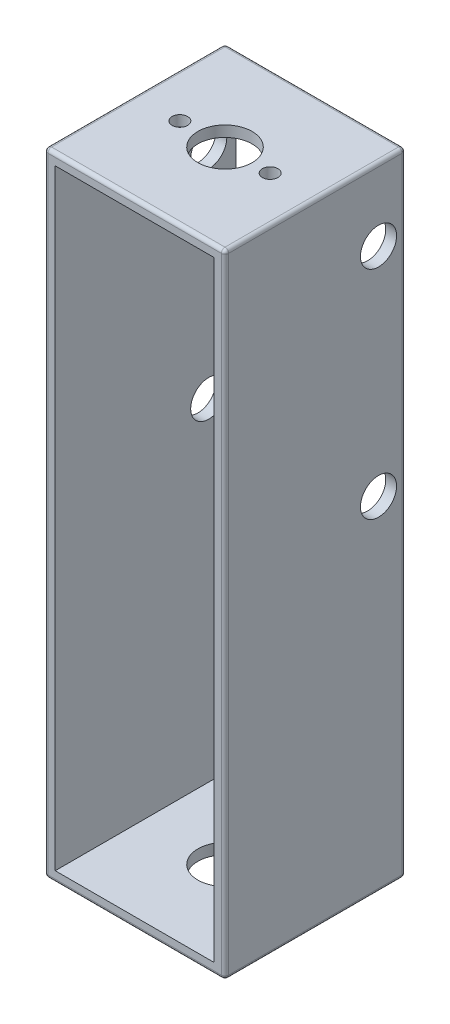
ISO-10303-21;
HEADER;
FILE_DESCRIPTION(('STEP AP214'),'2;1');
FILE_NAME('part.step','',(''),(''),'','','');
FILE_SCHEMA(('AUTOMOTIVE_DESIGN { 1 0 10303 214 1 1 1 1 }'));
ENDSEC;
DATA;
#1=APPLICATION_CONTEXT('core data for automotive mechanical design processes');
#2=APPLICATION_PROTOCOL_DEFINITION('international standard','automotive_design',2000,#1);
#3=PRODUCT_CONTEXT('',#1,'mechanical');
#4=PRODUCT('Part','Part','',(#3));
#5=PRODUCT_RELATED_PRODUCT_CATEGORY('part','',(#4));
#6=PRODUCT_DEFINITION_FORMATION('','',#4);
#7=PRODUCT_DEFINITION_CONTEXT('part definition',#1,'design');
#8=PRODUCT_DEFINITION('design','',#6,#7);
#9=PRODUCT_DEFINITION_SHAPE('','',#8);
#10=(LENGTH_UNIT() NAMED_UNIT(*) SI_UNIT(.MILLI.,.METRE.));
#11=(NAMED_UNIT(*) PLANE_ANGLE_UNIT() SI_UNIT($,.RADIAN.));
#12=(NAMED_UNIT(*) SI_UNIT($,.STERADIAN.) SOLID_ANGLE_UNIT());
#13=UNCERTAINTY_MEASURE_WITH_UNIT(LENGTH_MEASURE(1.E-05),#10,'distance_accuracy_value','');
#14=(GEOMETRIC_REPRESENTATION_CONTEXT(3) GLOBAL_UNCERTAINTY_ASSIGNED_CONTEXT((#13)) GLOBAL_UNIT_ASSIGNED_CONTEXT((#10,
#11,#12)) REPRESENTATION_CONTEXT('',''));
#15=CARTESIAN_POINT('',(0.,0.,0.));
#16=DIRECTION('',(0.,0.,1.));
#17=DIRECTION('',(1.,0.,0.));
#18=AXIS2_PLACEMENT_3D('',#15,#16,#17);
#19=CARTESIAN_POINT('',(25.,-175.,-25.));
#20=DIRECTION('',(0.,0.,-1.));
#21=DIRECTION('',(-1.,0.,0.));
#22=AXIS2_PLACEMENT_3D('',#19,#20,#21);
#23=PLANE('',#22);
#24=DIRECTION('',(0.,1.,0.));
#25=VECTOR('',#24,1.);
#26=CARTESIAN_POINT('',(24.,-175.,-25.));
#27=LINE('',#26,#25);
#28=CARTESIAN_POINT('',(24.,-1.,-25.));
#29=VERTEX_POINT('',#28);
#30=CARTESIAN_POINT('',(24.,-174.,-25.));
#31=VERTEX_POINT('',#30);
#32=EDGE_CURVE('E219',#29,#31,#27,.F.);
#33=ORIENTED_EDGE('',*,*,#32,.T.);
#34=DIRECTION('',(-1.,0.,0.));
#35=VECTOR('',#34,1.);
#36=CARTESIAN_POINT('',(-25.,-174.,-25.));
#37=LINE('',#36,#35);
#38=CARTESIAN_POINT('',(-24.,-174.,-25.));
#39=VERTEX_POINT('',#38);
#40=EDGE_CURVE('E221',#31,#39,#37,.T.);
#41=ORIENTED_EDGE('',*,*,#40,.T.);
#42=DIRECTION('',(0.,1.,0.));
#43=VECTOR('',#42,1.);
#44=CARTESIAN_POINT('',(-24.,-175.,-25.));
#45=LINE('',#44,#43);
#46=CARTESIAN_POINT('',(-24.,-1.,-25.));
#47=VERTEX_POINT('',#46);
#48=EDGE_CURVE('E215',#39,#47,#45,.T.);
#49=ORIENTED_EDGE('',*,*,#48,.T.);
#50=DIRECTION('',(-1.,0.,0.));
#51=VECTOR('',#50,1.);
#52=CARTESIAN_POINT('',(25.,-1.,-25.));
#53=LINE('',#52,#51);
#54=EDGE_CURVE('E217',#47,#29,#53,.F.);
#55=ORIENTED_EDGE('',*,*,#54,.T.);
#56=EDGE_LOOP('',(#33,#41,#49,#55));
#57=FACE_BOUND('',#56,.T.);
#58=DIRECTION('',(0.,1.,0.));
#59=VECTOR('',#58,1.);
#60=CARTESIAN_POINT('',(22.,-175.,-25.));
#61=LINE('',#60,#59);
#62=CARTESIAN_POINT('',(22.,-172.,-25.));
#63=VERTEX_POINT('',#62);
#64=CARTESIAN_POINT('',(22.,-3.,-25.));
#65=VERTEX_POINT('',#64);
#66=EDGE_CURVE('E161',#63,#65,#61,.T.);
#67=ORIENTED_EDGE('',*,*,#66,.T.);
#68=DIRECTION('',(-1.,0.,0.));
#69=VECTOR('',#68,1.);
#70=CARTESIAN_POINT('',(0.,-3.,-25.));
#71=LINE('',#70,#69);
#72=CARTESIAN_POINT('',(-22.,-3.,-25.));
#73=VERTEX_POINT('',#72);
#74=EDGE_CURVE('E167',#65,#73,#71,.T.);
#75=ORIENTED_EDGE('',*,*,#74,.T.);
#76=DIRECTION('',(0.,1.,0.));
#77=VECTOR('',#76,1.);
#78=CARTESIAN_POINT('',(-22.,-175.,-25.));
#79=LINE('',#78,#77);
#80=CARTESIAN_POINT('',(-22.,-172.,-25.));
#81=VERTEX_POINT('',#80);
#82=EDGE_CURVE('E150',#81,#73,#79,.T.);
#83=ORIENTED_EDGE('',*,*,#82,.F.);
#84=DIRECTION('',(-1.,0.,0.));
#85=VECTOR('',#84,1.);
#86=CARTESIAN_POINT('',(0.,-172.,-25.));
#87=LINE('',#86,#85);
#88=EDGE_CURVE('E181',#63,#81,#87,.T.);
#89=ORIENTED_EDGE('',*,*,#88,.F.);
#90=EDGE_LOOP('',(#67,#75,#83,#89));
#91=FACE_BOUND('',#90,.T.);
#92=ADVANCED_FACE('F33',(#57,#91),#23,.T.);
#93=CARTESIAN_POINT('',(25.,-175.,25.));
#94=DIRECTION('',(0.,0.,1.));
#95=DIRECTION('',(1.,0.,0.));
#96=AXIS2_PLACEMENT_3D('',#93,#94,#95);
#97=PLANE('',#96);
#98=DIRECTION('',(0.,1.,0.));
#99=VECTOR('',#98,1.);
#100=CARTESIAN_POINT('',(-24.,-175.,25.));
#101=LINE('',#100,#99);
#102=CARTESIAN_POINT('',(-24.,-1.,25.));
#103=VERTEX_POINT('',#102);
#104=CARTESIAN_POINT('',(-24.,-174.,25.));
#105=VERTEX_POINT('',#104);
#106=EDGE_CURVE('E237',#103,#105,#101,.F.);
#107=ORIENTED_EDGE('',*,*,#106,.T.);
#108=DIRECTION('',(1.,0.,0.));
#109=VECTOR('',#108,1.);
#110=CARTESIAN_POINT('',(25.,-174.,25.));
#111=LINE('',#110,#109);
#112=CARTESIAN_POINT('',(24.,-174.,25.));
#113=VERTEX_POINT('',#112);
#114=EDGE_CURVE('E239',#105,#113,#111,.T.);
#115=ORIENTED_EDGE('',*,*,#114,.T.);
#116=DIRECTION('',(0.,1.,0.));
#117=VECTOR('',#116,1.);
#118=CARTESIAN_POINT('',(24.,-175.,25.));
#119=LINE('',#118,#117);
#120=CARTESIAN_POINT('',(24.,-1.,25.));
#121=VERTEX_POINT('',#120);
#122=EDGE_CURVE('E235',#113,#121,#119,.T.);
#123=ORIENTED_EDGE('',*,*,#122,.T.);
#124=DIRECTION('',(1.,0.,0.));
#125=VECTOR('',#124,1.);
#126=CARTESIAN_POINT('',(25.,-1.,25.));
#127=LINE('',#126,#125);
#128=EDGE_CURVE('E233',#121,#103,#127,.F.);
#129=ORIENTED_EDGE('',*,*,#128,.T.);
#130=EDGE_LOOP('',(#107,#115,#123,#129));
#131=FACE_BOUND('',#130,.T.);
#132=DIRECTION('',(0.,1.,0.));
#133=VECTOR('',#132,1.);
#134=CARTESIAN_POINT('',(-22.,-175.,25.));
#135=LINE('',#134,#133);
#136=CARTESIAN_POINT('',(-22.,-172.,25.));
#137=VERTEX_POINT('',#136);
#138=CARTESIAN_POINT('',(-22.,-3.,25.));
#139=VERTEX_POINT('',#138);
#140=EDGE_CURVE('E183',#137,#139,#135,.T.);
#141=ORIENTED_EDGE('',*,*,#140,.T.);
#142=DIRECTION('',(1.,0.,0.));
#143=VECTOR('',#142,1.);
#144=CARTESIAN_POINT('',(0.,-3.,25.));
#145=LINE('',#144,#143);
#146=CARTESIAN_POINT('',(22.,-3.,25.));
#147=VERTEX_POINT('',#146);
#148=EDGE_CURVE('E170',#139,#147,#145,.T.);
#149=ORIENTED_EDGE('',*,*,#148,.T.);
#150=DIRECTION('',(0.,1.,0.));
#151=VECTOR('',#150,1.);
#152=CARTESIAN_POINT('',(22.,-175.,25.));
#153=LINE('',#152,#151);
#154=CARTESIAN_POINT('',(22.,-172.,25.));
#155=VERTEX_POINT('',#154);
#156=EDGE_CURVE('E180',#155,#147,#153,.T.);
#157=ORIENTED_EDGE('',*,*,#156,.F.);
#158=DIRECTION('',(1.,0.,0.));
#159=VECTOR('',#158,1.);
#160=CARTESIAN_POINT('',(0.,-172.,25.));
#161=LINE('',#160,#159);
#162=EDGE_CURVE('E175',#137,#155,#161,.T.);
#163=ORIENTED_EDGE('',*,*,#162,.F.);
#164=EDGE_LOOP('',(#141,#149,#157,#163));
#165=FACE_BOUND('',#164,.T.);
#166=ADVANCED_FACE('F362',(#131,#165),#97,.T.);
#167=CARTESIAN_POINT('',(-25.,-175.,25.));
#168=DIRECTION('',(-1.,0.,0.));
#169=DIRECTION('',(0.,0.,1.));
#170=AXIS2_PLACEMENT_3D('',#167,#168,#169);
#171=PLANE('',#170);
#172=DIRECTION('',(0.,1.,0.));
#173=VECTOR('',#172,1.);
#174=CARTESIAN_POINT('',(-25.,-175.,-24.));
#175=LINE('',#174,#173);
#176=CARTESIAN_POINT('',(-25.,-1.,-24.));
#177=VERTEX_POINT('',#176);
#178=CARTESIAN_POINT('',(-25.,-174.,-24.));
#179=VERTEX_POINT('',#178);
#180=EDGE_CURVE('E201',#177,#179,#175,.F.);
#181=ORIENTED_EDGE('',*,*,#180,.T.);
#182=DIRECTION('',(0.,0.,1.));
#183=VECTOR('',#182,1.);
#184=CARTESIAN_POINT('',(-25.,-174.,25.));
#185=LINE('',#184,#183);
#186=CARTESIAN_POINT('',(-25.,-174.,24.));
#187=VERTEX_POINT('',#186);
#188=EDGE_CURVE('E203',#179,#187,#185,.T.);
#189=ORIENTED_EDGE('',*,*,#188,.T.);
#190=DIRECTION('',(0.,1.,0.));
#191=VECTOR('',#190,1.);
#192=CARTESIAN_POINT('',(-25.,-175.,24.));
#193=LINE('',#192,#191);
#194=CARTESIAN_POINT('',(-25.,-1.,24.));
#195=VERTEX_POINT('',#194);
#196=EDGE_CURVE('E160',#187,#195,#193,.T.);
#197=ORIENTED_EDGE('',*,*,#196,.T.);
#198=DIRECTION('',(0.,0.,1.));
#199=VECTOR('',#198,1.);
#200=CARTESIAN_POINT('',(-25.,-1.,25.));
#201=LINE('',#200,#199);
#202=EDGE_CURVE('E199',#195,#177,#201,.F.);
#203=ORIENTED_EDGE('',*,*,#202,.T.);
#204=EDGE_LOOP('',(#181,#189,#197,#203));
#205=FACE_BOUND('',#204,.T.);
#206=CARTESIAN_POINT('',(-25.,-20.,-17.5));
#207=DIRECTION('',(1.,0.,0.));
#208=DIRECTION('',(0.,0.,-1.));
#209=AXIS2_PLACEMENT_3D('',#206,#207,#208);
#210=CIRCLE('',#209,5.);
#211=CARTESIAN_POINT('',(-25.,-20.,-22.5));
#212=VERTEX_POINT('',#211);
#213=EDGE_CURVE('E193',#212,#212,#210,.T.);
#214=ORIENTED_EDGE('',*,*,#213,.T.);
#215=EDGE_LOOP('',(#214));
#216=FACE_BOUND('',#215,.T.);
#217=CARTESIAN_POINT('',(-25.,-80.,-17.5));
#218=DIRECTION('',(1.,0.,0.));
#219=DIRECTION('',(0.,0.,-1.));
#220=AXIS2_PLACEMENT_3D('',#217,#218,#219);
#221=CIRCLE('',#220,5.);
#222=CARTESIAN_POINT('',(-25.,-80.,-22.5));
#223=VERTEX_POINT('',#222);
#224=EDGE_CURVE('E317',#223,#223,#221,.T.);
#225=ORIENTED_EDGE('',*,*,#224,.T.);
#226=EDGE_LOOP('',(#225));
#227=FACE_BOUND('',#226,.T.);
#228=ADVANCED_FACE('F364',(#205,#216,#227),#171,.T.);
#229=CARTESIAN_POINT('',(25.,-175.,25.));
#230=DIRECTION('',(1.,0.,0.));
#231=DIRECTION('',(0.,0.,-1.));
#232=AXIS2_PLACEMENT_3D('',#229,#230,#231);
#233=PLANE('',#232);
#234=DIRECTION('',(0.,1.,0.));
#235=VECTOR('',#234,1.);
#236=CARTESIAN_POINT('',(25.,-175.,24.));
#237=LINE('',#236,#235);
#238=CARTESIAN_POINT('',(25.,-1.,24.));
#239=VERTEX_POINT('',#238);
#240=CARTESIAN_POINT('',(25.,-174.,24.));
#241=VERTEX_POINT('',#240);
#242=EDGE_CURVE('E226',#239,#241,#237,.F.);
#243=ORIENTED_EDGE('',*,*,#242,.T.);
#244=DIRECTION('',(0.,0.,-1.));
#245=VECTOR('',#244,1.);
#246=CARTESIAN_POINT('',(25.,-174.,-25.));
#247=LINE('',#246,#245);
#248=CARTESIAN_POINT('',(25.,-174.,-24.));
#249=VERTEX_POINT('',#248);
#250=EDGE_CURVE('E230',#241,#249,#247,.T.);
#251=ORIENTED_EDGE('',*,*,#250,.T.);
#252=DIRECTION('',(0.,1.,0.));
#253=VECTOR('',#252,1.);
#254=CARTESIAN_POINT('',(25.,-175.,-24.));
#255=LINE('',#254,#253);
#256=CARTESIAN_POINT('',(25.,-1.,-24.));
#257=VERTEX_POINT('',#256);
#258=EDGE_CURVE('E228',#249,#257,#255,.T.);
#259=ORIENTED_EDGE('',*,*,#258,.T.);
#260=DIRECTION('',(0.,0.,-1.));
#261=VECTOR('',#260,1.);
#262=CARTESIAN_POINT('',(25.,-1.,25.));
#263=LINE('',#262,#261);
#264=EDGE_CURVE('E224',#257,#239,#263,.F.);
#265=ORIENTED_EDGE('',*,*,#264,.T.);
#266=EDGE_LOOP('',(#243,#251,#259,#265));
#267=FACE_BOUND('',#266,.T.);
#268=CARTESIAN_POINT('',(25.,-20.,-17.5));
#269=DIRECTION('',(1.,0.,0.));
#270=DIRECTION('',(0.,0.,-1.));
#271=AXIS2_PLACEMENT_3D('',#268,#269,#270);
#272=CIRCLE('',#271,5.);
#273=CARTESIAN_POINT('',(25.,-20.,-22.5));
#274=VERTEX_POINT('',#273);
#275=EDGE_CURVE('E322',#274,#274,#272,.T.);
#276=ORIENTED_EDGE('',*,*,#275,.F.);
#277=EDGE_LOOP('',(#276));
#278=FACE_BOUND('',#277,.T.);
#279=CARTESIAN_POINT('',(25.,-80.,-17.5));
#280=DIRECTION('',(1.,0.,0.));
#281=DIRECTION('',(0.,0.,-1.));
#282=AXIS2_PLACEMENT_3D('',#279,#280,#281);
#283=CIRCLE('',#282,5.);
#284=CARTESIAN_POINT('',(25.,-80.,-22.5));
#285=VERTEX_POINT('',#284);
#286=EDGE_CURVE('E311',#285,#285,#283,.T.);
#287=ORIENTED_EDGE('',*,*,#286,.F.);
#288=EDGE_LOOP('',(#287));
#289=FACE_BOUND('',#288,.T.);
#290=ADVANCED_FACE('F371',(#267,#278,#289),#233,.T.);
#291=CARTESIAN_POINT('',(0.,-175.,0.));
#292=DIRECTION('',(0.,1.,0.));
#293=DIRECTION('',(0.,0.,1.));
#294=AXIS2_PLACEMENT_3D('',#291,#292,#293);
#295=PLANE('',#294);
#296=DIRECTION('',(1.,0.,0.));
#297=VECTOR('',#296,1.);
#298=CARTESIAN_POINT('',(-25.,-175.,24.));
#299=LINE('',#298,#297);
#300=CARTESIAN_POINT('',(24.,-175.,24.));
#301=VERTEX_POINT('',#300);
#302=CARTESIAN_POINT('',(-24.,-175.,24.));
#303=VERTEX_POINT('',#302);
#304=EDGE_CURVE('E206',#301,#303,#299,.F.);
#305=ORIENTED_EDGE('',*,*,#304,.T.);
#306=DIRECTION('',(0.,0.,1.));
#307=VECTOR('',#306,1.);
#308=CARTESIAN_POINT('',(-24.,-175.,-25.));
#309=LINE('',#308,#307);
#310=CARTESIAN_POINT('',(-24.,-175.,-24.));
#311=VERTEX_POINT('',#310);
#312=EDGE_CURVE('E212',#303,#311,#309,.F.);
#313=ORIENTED_EDGE('',*,*,#312,.T.);
#314=DIRECTION('',(-1.,0.,0.));
#315=VECTOR('',#314,1.);
#316=CARTESIAN_POINT('',(25.,-175.,-24.));
#317=LINE('',#316,#315);
#318=CARTESIAN_POINT('',(24.,-175.,-24.));
#319=VERTEX_POINT('',#318);
#320=EDGE_CURVE('E210',#311,#319,#317,.F.);
#321=ORIENTED_EDGE('',*,*,#320,.T.);
#322=DIRECTION('',(0.,0.,-1.));
#323=VECTOR('',#322,1.);
#324=CARTESIAN_POINT('',(24.,-175.,25.));
#325=LINE('',#324,#323);
#326=EDGE_CURVE('E208',#319,#301,#325,.F.);
#327=ORIENTED_EDGE('',*,*,#326,.T.);
#328=EDGE_LOOP('',(#305,#313,#321,#327));
#329=FACE_BOUND('',#328,.T.);
#330=CARTESIAN_POINT('',(0.,-175.,0.));
#331=DIRECTION('',(0.,1.,0.));
#332=DIRECTION('',(0.,0.,1.));
#333=AXIS2_PLACEMENT_3D('',#330,#331,#332);
#334=CIRCLE('',#333,7.5);
#335=CARTESIAN_POINT('',(0.,-175.,7.5));
#336=VERTEX_POINT('',#335);
#337=EDGE_CURVE('E330',#336,#336,#334,.T.);
#338=ORIENTED_EDGE('',*,*,#337,.T.);
#339=EDGE_LOOP('',(#338));
#340=FACE_BOUND('',#339,.T.);
#341=ADVANCED_FACE('F497',(#329,#340),#295,.F.);
#342=CARTESIAN_POINT('',(0.,0.,0.));
#343=DIRECTION('',(0.,1.,0.));
#344=DIRECTION('',(0.,0.,1.));
#345=AXIS2_PLACEMENT_3D('',#342,#343,#344);
#346=PLANE('',#345);
#347=DIRECTION('',(0.,0.,-1.));
#348=VECTOR('',#347,1.);
#349=CARTESIAN_POINT('',(24.,0.,0.));
#350=LINE('',#349,#348);
#351=CARTESIAN_POINT('',(24.,0.,24.));
#352=VERTEX_POINT('',#351);
#353=CARTESIAN_POINT('',(24.,0.,-24.));
#354=VERTEX_POINT('',#353);
#355=EDGE_CURVE('E242',#352,#354,#350,.T.);
#356=ORIENTED_EDGE('',*,*,#355,.T.);
#357=DIRECTION('',(-1.,0.,0.));
#358=VECTOR('',#357,1.);
#359=CARTESIAN_POINT('',(0.,0.,-24.));
#360=LINE('',#359,#358);
#361=CARTESIAN_POINT('',(-24.,0.,-24.));
#362=VERTEX_POINT('',#361);
#363=EDGE_CURVE('E11',#354,#362,#360,.T.);
#364=ORIENTED_EDGE('',*,*,#363,.T.);
#365=DIRECTION('',(0.,0.,1.));
#366=VECTOR('',#365,1.);
#367=CARTESIAN_POINT('',(-24.,0.,0.));
#368=LINE('',#367,#366);
#369=CARTESIAN_POINT('',(-24.,0.,24.));
#370=VERTEX_POINT('',#369);
#371=EDGE_CURVE('E42',#362,#370,#368,.T.);
#372=ORIENTED_EDGE('',*,*,#371,.T.);
#373=DIRECTION('',(1.,0.,0.));
#374=VECTOR('',#373,1.);
#375=CARTESIAN_POINT('',(0.,0.,24.));
#376=LINE('',#375,#374);
#377=EDGE_CURVE('E244',#370,#352,#376,.T.);
#378=ORIENTED_EDGE('',*,*,#377,.T.);
#379=EDGE_LOOP('',(#356,#364,#372,#378));
#380=FACE_BOUND('',#379,.T.);
#381=CARTESIAN_POINT('',(12.5,0.,0.));
#382=DIRECTION('',(0.,1.,0.));
#383=DIRECTION('',(0.,0.,1.));
#384=AXIS2_PLACEMENT_3D('',#381,#382,#383);
#385=CIRCLE('',#384,2.15);
#386=CARTESIAN_POINT('',(12.5,0.,2.15));
#387=VERTEX_POINT('',#386);
#388=EDGE_CURVE('E336',#387,#387,#385,.T.);
#389=ORIENTED_EDGE('',*,*,#388,.F.);
#390=EDGE_LOOP('',(#389));
#391=FACE_BOUND('',#390,.T.);
#392=CARTESIAN_POINT('',(-12.5,0.,0.));
#393=DIRECTION('',(0.,1.,0.));
#394=DIRECTION('',(0.,0.,1.));
#395=AXIS2_PLACEMENT_3D('',#392,#393,#394);
#396=CIRCLE('',#395,2.15);
#397=CARTESIAN_POINT('',(-12.5,0.,2.15));
#398=VERTEX_POINT('',#397);
#399=EDGE_CURVE('E337',#398,#398,#396,.T.);
#400=ORIENTED_EDGE('',*,*,#399,.F.);
#401=EDGE_LOOP('',(#400));
#402=FACE_BOUND('',#401,.T.);
#403=CARTESIAN_POINT('',(0.,0.,0.));
#404=DIRECTION('',(0.,1.,0.));
#405=DIRECTION('',(0.,0.,1.));
#406=AXIS2_PLACEMENT_3D('',#403,#404,#405);
#407=CIRCLE('',#406,7.5);
#408=CARTESIAN_POINT('',(0.,0.,7.5));
#409=VERTEX_POINT('',#408);
#410=EDGE_CURVE('E344',#409,#409,#407,.T.);
#411=ORIENTED_EDGE('',*,*,#410,.F.);
#412=EDGE_LOOP('',(#411));
#413=FACE_BOUND('',#412,.T.);
#414=ADVANCED_FACE('F457',(#380,#391,#402,#413),#346,.T.);
#415=CARTESIAN_POINT('',(-22.,-175.,25.));
#416=DIRECTION('',(-1.,0.,0.));
#417=DIRECTION('',(0.,0.,1.));
#418=AXIS2_PLACEMENT_3D('',#415,#416,#417);
#419=PLANE('',#418);
#420=CARTESIAN_POINT('',(-22.,-20.,-17.5));
#421=DIRECTION('',(-1.,0.,0.));
#422=DIRECTION('',(0.,0.,1.));
#423=AXIS2_PLACEMENT_3D('',#420,#421,#422);
#424=CIRCLE('',#423,5.);
#425=CARTESIAN_POINT('',(-22.,-20.,-12.5));
#426=VERTEX_POINT('',#425);
#427=EDGE_CURVE('E197',#426,#426,#424,.T.);
#428=ORIENTED_EDGE('',*,*,#427,.T.);
#429=EDGE_LOOP('',(#428));
#430=FACE_BOUND('',#429,.T.);
#431=CARTESIAN_POINT('',(-22.,-80.,-17.5));
#432=DIRECTION('',(-1.,0.,0.));
#433=DIRECTION('',(0.,0.,1.));
#434=AXIS2_PLACEMENT_3D('',#431,#432,#433);
#435=CIRCLE('',#434,5.);
#436=CARTESIAN_POINT('',(-22.,-80.,-12.5));
#437=VERTEX_POINT('',#436);
#438=EDGE_CURVE('E192',#437,#437,#435,.T.);
#439=ORIENTED_EDGE('',*,*,#438,.T.);
#440=EDGE_LOOP('',(#439));
#441=FACE_BOUND('',#440,.T.);
#442=DIRECTION('',(0.,0.,1.));
#443=VECTOR('',#442,1.);
#444=CARTESIAN_POINT('',(-22.,-3.,0.));
#445=LINE('',#444,#443);
#446=EDGE_CURVE('E153',#73,#139,#445,.T.);
#447=ORIENTED_EDGE('',*,*,#446,.T.);
#448=ORIENTED_EDGE('',*,*,#140,.F.);
#449=DIRECTION('',(0.,0.,1.));
#450=VECTOR('',#449,1.);
#451=CARTESIAN_POINT('',(-22.,-172.,0.));
#452=LINE('',#451,#450);
#453=EDGE_CURVE('E156',#81,#137,#452,.T.);
#454=ORIENTED_EDGE('',*,*,#453,.F.);
#455=ORIENTED_EDGE('',*,*,#82,.T.);
#456=EDGE_LOOP('',(#447,#448,#454,#455));
#457=FACE_BOUND('',#456,.T.);
#458=ADVANCED_FACE('F152',(#430,#441,#457),#419,.F.);
#459=CARTESIAN_POINT('',(22.,-175.,25.));
#460=DIRECTION('',(1.,0.,0.));
#461=DIRECTION('',(0.,0.,-1.));
#462=AXIS2_PLACEMENT_3D('',#459,#460,#461);
#463=PLANE('',#462);
#464=CARTESIAN_POINT('',(22.,-20.,-17.5));
#465=DIRECTION('',(1.,0.,0.));
#466=DIRECTION('',(0.,0.,-1.));
#467=AXIS2_PLACEMENT_3D('',#464,#465,#466);
#468=CIRCLE('',#467,5.);
#469=CARTESIAN_POINT('',(22.,-20.,-22.5));
#470=VERTEX_POINT('',#469);
#471=EDGE_CURVE('E194',#470,#470,#468,.T.);
#472=ORIENTED_EDGE('',*,*,#471,.T.);
#473=EDGE_LOOP('',(#472));
#474=FACE_BOUND('',#473,.T.);
#475=CARTESIAN_POINT('',(22.,-80.,-17.5));
#476=DIRECTION('',(1.,0.,0.));
#477=DIRECTION('',(0.,0.,-1.));
#478=AXIS2_PLACEMENT_3D('',#475,#476,#477);
#479=CIRCLE('',#478,5.);
#480=CARTESIAN_POINT('',(22.,-80.,-22.5));
#481=VERTEX_POINT('',#480);
#482=EDGE_CURVE('E189',#481,#481,#479,.T.);
#483=ORIENTED_EDGE('',*,*,#482,.T.);
#484=EDGE_LOOP('',(#483));
#485=FACE_BOUND('',#484,.T.);
#486=DIRECTION('',(0.,0.,-1.));
#487=VECTOR('',#486,1.);
#488=CARTESIAN_POINT('',(22.,-3.,0.));
#489=LINE('',#488,#487);
#490=EDGE_CURVE('E173',#147,#65,#489,.T.);
#491=ORIENTED_EDGE('',*,*,#490,.T.);
#492=ORIENTED_EDGE('',*,*,#66,.F.);
#493=DIRECTION('',(0.,0.,-1.));
#494=VECTOR('',#493,1.);
#495=CARTESIAN_POINT('',(22.,-172.,0.));
#496=LINE('',#495,#494);
#497=EDGE_CURVE('E184',#155,#63,#496,.T.);
#498=ORIENTED_EDGE('',*,*,#497,.F.);
#499=ORIENTED_EDGE('',*,*,#156,.T.);
#500=EDGE_LOOP('',(#491,#492,#498,#499));
#501=FACE_BOUND('',#500,.T.);
#502=ADVANCED_FACE('F360',(#474,#485,#501),#463,.F.);
#503=CARTESIAN_POINT('',(0.,-172.,0.));
#504=DIRECTION('',(0.,1.,0.));
#505=DIRECTION('',(0.,0.,1.));
#506=AXIS2_PLACEMENT_3D('',#503,#504,#505);
#507=PLANE('',#506);
#508=CARTESIAN_POINT('',(0.,-172.,0.));
#509=DIRECTION('',(0.,1.,0.));
#510=DIRECTION('',(0.,0.,1.));
#511=AXIS2_PLACEMENT_3D('',#508,#509,#510);
#512=CIRCLE('',#511,7.5);
#513=CARTESIAN_POINT('',(0.,-172.,7.5));
#514=VERTEX_POINT('',#513);
#515=EDGE_CURVE('E333',#514,#514,#512,.T.);
#516=ORIENTED_EDGE('',*,*,#515,.F.);
#517=EDGE_LOOP('',(#516));
#518=FACE_BOUND('',#517,.T.);
#519=ORIENTED_EDGE('',*,*,#453,.T.);
#520=ORIENTED_EDGE('',*,*,#162,.T.);
#521=ORIENTED_EDGE('',*,*,#497,.T.);
#522=ORIENTED_EDGE('',*,*,#88,.T.);
#523=EDGE_LOOP('',(#519,#520,#521,#522));
#524=FACE_BOUND('',#523,.T.);
#525=ADVANCED_FACE('F356',(#518,#524),#507,.T.);
#526=CARTESIAN_POINT('',(0.,-3.,0.));
#527=DIRECTION('',(0.,1.,0.));
#528=DIRECTION('',(0.,0.,1.));
#529=AXIS2_PLACEMENT_3D('',#526,#527,#528);
#530=PLANE('',#529);
#531=CARTESIAN_POINT('',(12.5,-3.,0.));
#532=DIRECTION('',(0.,1.,0.));
#533=DIRECTION('',(0.,0.,1.));
#534=AXIS2_PLACEMENT_3D('',#531,#532,#533);
#535=CIRCLE('',#534,2.15);
#536=CARTESIAN_POINT('',(12.5,-3.,2.15));
#537=VERTEX_POINT('',#536);
#538=EDGE_CURVE('E341',#537,#537,#535,.F.);
#539=ORIENTED_EDGE('',*,*,#538,.F.);
#540=EDGE_LOOP('',(#539));
#541=FACE_BOUND('',#540,.T.);
#542=CARTESIAN_POINT('',(-12.5,-3.,0.));
#543=DIRECTION('',(0.,1.,0.));
#544=DIRECTION('',(0.,0.,1.));
#545=AXIS2_PLACEMENT_3D('',#542,#543,#544);
#546=CIRCLE('',#545,2.15);
#547=CARTESIAN_POINT('',(-12.5,-3.,2.15));
#548=VERTEX_POINT('',#547);
#549=EDGE_CURVE('E340',#548,#548,#546,.F.);
#550=ORIENTED_EDGE('',*,*,#549,.F.);
#551=EDGE_LOOP('',(#550));
#552=FACE_BOUND('',#551,.T.);
#553=CARTESIAN_POINT('',(0.,-3.,0.));
#554=DIRECTION('',(0.,1.,0.));
#555=DIRECTION('',(0.,0.,1.));
#556=AXIS2_PLACEMENT_3D('',#553,#554,#555);
#557=CIRCLE('',#556,7.5);
#558=CARTESIAN_POINT('',(0.,-3.,7.5));
#559=VERTEX_POINT('',#558);
#560=EDGE_CURVE('E171',#559,#559,#557,.F.);
#561=ORIENTED_EDGE('',*,*,#560,.F.);
#562=EDGE_LOOP('',(#561));
#563=FACE_BOUND('',#562,.T.);
#564=ORIENTED_EDGE('',*,*,#446,.F.);
#565=ORIENTED_EDGE('',*,*,#74,.F.);
#566=ORIENTED_EDGE('',*,*,#490,.F.);
#567=ORIENTED_EDGE('',*,*,#148,.F.);
#568=EDGE_LOOP('',(#564,#565,#566,#567));
#569=FACE_BOUND('',#568,.T.);
#570=ADVANCED_FACE('F165',(#541,#552,#563,#569),#530,.F.);
#571=CARTESIAN_POINT('',(0.,-175.001,0.));
#572=DIRECTION('',(0.,1.,0.));
#573=DIRECTION('',(0.,0.,1.));
#574=AXIS2_PLACEMENT_3D('',#571,#572,#573);
#575=CYLINDRICAL_SURFACE('',#574,7.5);
#576=ORIENTED_EDGE('',*,*,#410,.T.);
#577=EDGE_LOOP('',(#576));
#578=FACE_BOUND('',#577,.T.);
#579=ORIENTED_EDGE('',*,*,#560,.T.);
#580=EDGE_LOOP('',(#579));
#581=FACE_BOUND('',#580,.T.);
#582=ADVANCED_FACE('F522',(#578,#581),#575,.F.);
#583=CARTESIAN_POINT('',(-12.5,-175.001,0.));
#584=DIRECTION('',(0.,1.,0.));
#585=DIRECTION('',(0.,0.,1.));
#586=AXIS2_PLACEMENT_3D('',#583,#584,#585);
#587=CYLINDRICAL_SURFACE('',#586,2.15);
#588=ORIENTED_EDGE('',*,*,#399,.T.);
#589=EDGE_LOOP('',(#588));
#590=FACE_BOUND('',#589,.T.);
#591=ORIENTED_EDGE('',*,*,#549,.T.);
#592=EDGE_LOOP('',(#591));
#593=FACE_BOUND('',#592,.T.);
#594=ADVANCED_FACE('F516',(#590,#593),#587,.F.);
#595=CARTESIAN_POINT('',(12.5,-175.001,0.));
#596=DIRECTION('',(0.,1.,0.));
#597=DIRECTION('',(0.,0.,1.));
#598=AXIS2_PLACEMENT_3D('',#595,#596,#597);
#599=CYLINDRICAL_SURFACE('',#598,2.15);
#600=ORIENTED_EDGE('',*,*,#388,.T.);
#601=EDGE_LOOP('',(#600));
#602=FACE_BOUND('',#601,.T.);
#603=ORIENTED_EDGE('',*,*,#538,.T.);
#604=EDGE_LOOP('',(#603));
#605=FACE_BOUND('',#604,.T.);
#606=ADVANCED_FACE('F506',(#602,#605),#599,.F.);
#607=CARTESIAN_POINT('',(0.,-175.,0.));
#608=DIRECTION('',(0.,1.,0.));
#609=DIRECTION('',(0.,0.,1.));
#610=AXIS2_PLACEMENT_3D('',#607,#608,#609);
#611=CYLINDRICAL_SURFACE('',#610,7.5);
#612=ORIENTED_EDGE('',*,*,#515,.T.);
#613=EDGE_LOOP('',(#612));
#614=FACE_BOUND('',#613,.T.);
#615=ORIENTED_EDGE('',*,*,#337,.F.);
#616=EDGE_LOOP('',(#615));
#617=FACE_BOUND('',#616,.T.);
#618=ADVANCED_FACE('F503',(#614,#617),#611,.F.);
#619=CARTESIAN_POINT('',(-25.,-80.,-17.5));
#620=DIRECTION('',(1.,0.,0.));
#621=DIRECTION('',(0.,0.,-1.));
#622=AXIS2_PLACEMENT_3D('',#619,#620,#621);
#623=CYLINDRICAL_SURFACE('',#622,5.);
#624=ORIENTED_EDGE('',*,*,#286,.T.);
#625=EDGE_LOOP('',(#624));
#626=FACE_BOUND('',#625,.T.);
#627=ORIENTED_EDGE('',*,*,#482,.F.);
#628=EDGE_LOOP('',(#627));
#629=FACE_BOUND('',#628,.T.);
#630=ADVANCED_FACE('F505',(#626,#629),#623,.F.);
#631=CARTESIAN_POINT('',(-25.,-20.,-17.5));
#632=DIRECTION('',(1.,0.,0.));
#633=DIRECTION('',(0.,0.,-1.));
#634=AXIS2_PLACEMENT_3D('',#631,#632,#633);
#635=CYLINDRICAL_SURFACE('',#634,5.);
#636=ORIENTED_EDGE('',*,*,#275,.T.);
#637=EDGE_LOOP('',(#636));
#638=FACE_BOUND('',#637,.T.);
#639=ORIENTED_EDGE('',*,*,#471,.F.);
#640=EDGE_LOOP('',(#639));
#641=FACE_BOUND('',#640,.T.);
#642=ADVANCED_FACE('F513',(#638,#641),#635,.F.);
#643=ORIENTED_EDGE('',*,*,#224,.F.);
#644=EDGE_LOOP('',(#643));
#645=FACE_BOUND('',#644,.T.);
#646=ORIENTED_EDGE('',*,*,#438,.F.);
#647=EDGE_LOOP('',(#646));
#648=FACE_BOUND('',#647,.T.);
#649=ADVANCED_FACE('F515',(#645,#648),#623,.F.);
#650=ORIENTED_EDGE('',*,*,#213,.F.);
#651=EDGE_LOOP('',(#650));
#652=FACE_BOUND('',#651,.T.);
#653=ORIENTED_EDGE('',*,*,#427,.F.);
#654=EDGE_LOOP('',(#653));
#655=FACE_BOUND('',#654,.T.);
#656=ADVANCED_FACE('F452',(#652,#655),#635,.F.);
#657=CARTESIAN_POINT('',(24.,-1.,0.));
#658=DIRECTION('',(0.,0.,-1.));
#659=DIRECTION('',(-1.,0.,0.));
#660=AXIS2_PLACEMENT_3D('',#657,#658,#659);
#661=CYLINDRICAL_SURFACE('',#660,1.);
#662=CARTESIAN_POINT('',(24.,-1.,-24.));
#663=DIRECTION('',(0.,0.,-1.));
#664=DIRECTION('',(-1.,0.,0.));
#665=AXIS2_PLACEMENT_3D('',#662,#663,#664);
#666=CIRCLE('',#665,1.);
#667=EDGE_CURVE('E37',#354,#257,#666,.T.);
#668=ORIENTED_EDGE('',*,*,#667,.F.);
#669=ORIENTED_EDGE('',*,*,#355,.F.);
#670=CARTESIAN_POINT('',(24.,-1.,24.));
#671=DIRECTION('',(0.,0.,1.));
#672=DIRECTION('',(1.,0.,0.));
#673=AXIS2_PLACEMENT_3D('',#670,#671,#672);
#674=CIRCLE('',#673,1.);
#675=EDGE_CURVE('E304',#239,#352,#674,.T.);
#676=ORIENTED_EDGE('',*,*,#675,.F.);
#677=ORIENTED_EDGE('',*,*,#264,.F.);
#678=EDGE_LOOP('',(#668,#669,#676,#677));
#679=FACE_BOUND('',#678,.T.);
#680=ADVANCED_FACE('F35',(#679),#661,.T.);
#681=CARTESIAN_POINT('',(24.,-1.,-24.));
#682=DIRECTION('',(1.,0.,0.));
#683=DIRECTION('',(0.,0.,-1.));
#684=AXIS2_PLACEMENT_3D('',#681,#682,#683);
#685=SPHERICAL_SURFACE('',#684,1.);
#686=CARTESIAN_POINT('',(24.,-1.,-24.));
#687=DIRECTION('',(1.,0.,0.));
#688=DIRECTION('',(0.,0.,-1.));
#689=AXIS2_PLACEMENT_3D('',#686,#687,#688);
#690=CIRCLE('',#689,1.);
#691=EDGE_CURVE('E299',#354,#29,#690,.F.);
#692=ORIENTED_EDGE('',*,*,#691,.F.);
#693=ORIENTED_EDGE('',*,*,#667,.T.);
#694=CARTESIAN_POINT('',(24.,-1.,-24.));
#695=DIRECTION('',(0.,1.,0.));
#696=DIRECTION('',(0.,0.,1.));
#697=AXIS2_PLACEMENT_3D('',#694,#695,#696);
#698=CIRCLE('',#697,1.);
#699=EDGE_CURVE('E302',#29,#257,#698,.F.);
#700=ORIENTED_EDGE('',*,*,#699,.F.);
#701=EDGE_LOOP('',(#692,#693,#700));
#702=FACE_BOUND('',#701,.T.);
#703=ADVANCED_FACE('F447',(#702),#685,.T.);
#704=CARTESIAN_POINT('',(24.,-1.,24.));
#705=DIRECTION('',(0.,1.,0.));
#706=DIRECTION('',(0.,0.,1.));
#707=AXIS2_PLACEMENT_3D('',#704,#705,#706);
#708=SPHERICAL_SURFACE('',#707,1.);
#709=CARTESIAN_POINT('',(24.,-1.,24.));
#710=DIRECTION('',(0.,1.,0.));
#711=DIRECTION('',(0.,0.,1.));
#712=AXIS2_PLACEMENT_3D('',#709,#710,#711);
#713=CIRCLE('',#712,1.);
#714=EDGE_CURVE('E293',#239,#121,#713,.F.);
#715=ORIENTED_EDGE('',*,*,#714,.F.);
#716=ORIENTED_EDGE('',*,*,#675,.T.);
#717=CARTESIAN_POINT('',(24.,-1.,24.));
#718=DIRECTION('',(1.,0.,0.));
#719=DIRECTION('',(0.,0.,-1.));
#720=AXIS2_PLACEMENT_3D('',#717,#718,#719);
#721=CIRCLE('',#720,1.);
#722=EDGE_CURVE('E296',#121,#352,#721,.F.);
#723=ORIENTED_EDGE('',*,*,#722,.F.);
#724=EDGE_LOOP('',(#715,#716,#723));
#725=FACE_BOUND('',#724,.T.);
#726=ADVANCED_FACE('F444',(#725),#708,.T.);
#727=CARTESIAN_POINT('',(24.,-175.,-24.));
#728=DIRECTION('',(0.,1.,0.));
#729=DIRECTION('',(0.,0.,1.));
#730=AXIS2_PLACEMENT_3D('',#727,#728,#729);
#731=CYLINDRICAL_SURFACE('',#730,1.);
#732=ORIENTED_EDGE('',*,*,#699,.T.);
#733=ORIENTED_EDGE('',*,*,#258,.F.);
#734=CARTESIAN_POINT('',(24.,-174.,-24.));
#735=DIRECTION('',(0.,-1.,0.));
#736=DIRECTION('',(0.,0.,-1.));
#737=AXIS2_PLACEMENT_3D('',#734,#735,#736);
#738=CIRCLE('',#737,1.);
#739=EDGE_CURVE('E288',#31,#249,#738,.T.);
#740=ORIENTED_EDGE('',*,*,#739,.F.);
#741=ORIENTED_EDGE('',*,*,#32,.F.);
#742=EDGE_LOOP('',(#732,#733,#740,#741));
#743=FACE_BOUND('',#742,.T.);
#744=ADVANCED_FACE('F440',(#743),#731,.T.);
#745=CARTESIAN_POINT('',(0.,-1.,-24.));
#746=DIRECTION('',(-1.,0.,0.));
#747=DIRECTION('',(0.,0.,1.));
#748=AXIS2_PLACEMENT_3D('',#745,#746,#747);
#749=CYLINDRICAL_SURFACE('',#748,1.);
#750=ORIENTED_EDGE('',*,*,#691,.T.);
#751=ORIENTED_EDGE('',*,*,#54,.F.);
#752=CARTESIAN_POINT('',(-24.,-1.,-24.));
#753=DIRECTION('',(-1.,0.,0.));
#754=DIRECTION('',(0.,0.,1.));
#755=AXIS2_PLACEMENT_3D('',#752,#753,#754);
#756=CIRCLE('',#755,1.);
#757=EDGE_CURVE('E286',#362,#47,#756,.T.);
#758=ORIENTED_EDGE('',*,*,#757,.F.);
#759=ORIENTED_EDGE('',*,*,#363,.F.);
#760=EDGE_LOOP('',(#750,#751,#758,#759));
#761=FACE_BOUND('',#760,.T.);
#762=ADVANCED_FACE('F436',(#761),#749,.T.);
#763=CARTESIAN_POINT('',(-24.,-1.,0.));
#764=DIRECTION('',(0.,0.,1.));
#765=DIRECTION('',(1.,0.,0.));
#766=AXIS2_PLACEMENT_3D('',#763,#764,#765);
#767=CYLINDRICAL_SURFACE('',#766,1.);
#768=CARTESIAN_POINT('',(-24.,-1.,24.));
#769=DIRECTION('',(0.,0.,1.));
#770=DIRECTION('',(1.,0.,0.));
#771=AXIS2_PLACEMENT_3D('',#768,#769,#770);
#772=CIRCLE('',#771,1.);
#773=EDGE_CURVE('E282',#370,#195,#772,.T.);
#774=ORIENTED_EDGE('',*,*,#773,.F.);
#775=ORIENTED_EDGE('',*,*,#371,.F.);
#776=CARTESIAN_POINT('',(-24.,-1.,-24.));
#777=DIRECTION('',(0.,0.,-1.));
#778=DIRECTION('',(-1.,0.,0.));
#779=AXIS2_PLACEMENT_3D('',#776,#777,#778);
#780=CIRCLE('',#779,1.);
#781=EDGE_CURVE('E50',#177,#362,#780,.T.);
#782=ORIENTED_EDGE('',*,*,#781,.F.);
#783=ORIENTED_EDGE('',*,*,#202,.F.);
#784=EDGE_LOOP('',(#774,#775,#782,#783));
#785=FACE_BOUND('',#784,.T.);
#786=ADVANCED_FACE('F432',(#785),#767,.T.);
#787=CARTESIAN_POINT('',(0.,-1.,24.));
#788=DIRECTION('',(1.,0.,0.));
#789=DIRECTION('',(0.,0.,-1.));
#790=AXIS2_PLACEMENT_3D('',#787,#788,#789);
#791=CYLINDRICAL_SURFACE('',#790,1.);
#792=ORIENTED_EDGE('',*,*,#722,.T.);
#793=ORIENTED_EDGE('',*,*,#377,.F.);
#794=CARTESIAN_POINT('',(-24.,-1.,24.));
#795=DIRECTION('',(-1.,0.,0.));
#796=DIRECTION('',(0.,0.,1.));
#797=AXIS2_PLACEMENT_3D('',#794,#795,#796);
#798=CIRCLE('',#797,1.);
#799=EDGE_CURVE('E279',#103,#370,#798,.T.);
#800=ORIENTED_EDGE('',*,*,#799,.F.);
#801=ORIENTED_EDGE('',*,*,#128,.F.);
#802=EDGE_LOOP('',(#792,#793,#800,#801));
#803=FACE_BOUND('',#802,.T.);
#804=ADVANCED_FACE('F428',(#803),#791,.T.);
#805=CARTESIAN_POINT('',(24.,-175.,24.));
#806=DIRECTION('',(0.,1.,0.));
#807=DIRECTION('',(0.,0.,1.));
#808=AXIS2_PLACEMENT_3D('',#805,#806,#807);
#809=CYLINDRICAL_SURFACE('',#808,1.);
#810=ORIENTED_EDGE('',*,*,#714,.T.);
#811=ORIENTED_EDGE('',*,*,#122,.F.);
#812=CARTESIAN_POINT('',(24.,-174.,24.));
#813=DIRECTION('',(0.,-1.,0.));
#814=DIRECTION('',(0.,0.,-1.));
#815=AXIS2_PLACEMENT_3D('',#812,#813,#814);
#816=CIRCLE('',#815,1.);
#817=EDGE_CURVE('E276',#241,#113,#816,.T.);
#818=ORIENTED_EDGE('',*,*,#817,.F.);
#819=ORIENTED_EDGE('',*,*,#242,.F.);
#820=EDGE_LOOP('',(#810,#811,#818,#819));
#821=FACE_BOUND('',#820,.T.);
#822=ADVANCED_FACE('F424',(#821),#809,.T.);
#823=CARTESIAN_POINT('',(24.,-174.,25.));
#824=DIRECTION('',(0.,0.,1.));
#825=DIRECTION('',(1.,0.,0.));
#826=AXIS2_PLACEMENT_3D('',#823,#824,#825);
#827=CYLINDRICAL_SURFACE('',#826,1.);
#828=CARTESIAN_POINT('',(24.,-174.,-24.));
#829=DIRECTION('',(0.,0.,-1.));
#830=DIRECTION('',(-1.,0.,0.));
#831=AXIS2_PLACEMENT_3D('',#828,#829,#830);
#832=CIRCLE('',#831,1.);
#833=EDGE_CURVE('E290',#249,#319,#832,.T.);
#834=ORIENTED_EDGE('',*,*,#833,.F.);
#835=ORIENTED_EDGE('',*,*,#250,.F.);
#836=CARTESIAN_POINT('',(24.,-174.,24.));
#837=DIRECTION('',(0.,0.,1.));
#838=DIRECTION('',(1.,0.,0.));
#839=AXIS2_PLACEMENT_3D('',#836,#837,#838);
#840=CIRCLE('',#839,1.);
#841=EDGE_CURVE('E273',#301,#241,#840,.T.);
#842=ORIENTED_EDGE('',*,*,#841,.F.);
#843=ORIENTED_EDGE('',*,*,#326,.F.);
#844=EDGE_LOOP('',(#834,#835,#842,#843));
#845=FACE_BOUND('',#844,.T.);
#846=ADVANCED_FACE('F420',(#845),#827,.T.);
#847=CARTESIAN_POINT('',(24.,-174.,-24.));
#848=DIRECTION('',(1.,0.,0.));
#849=DIRECTION('',(0.,0.,-1.));
#850=AXIS2_PLACEMENT_3D('',#847,#848,#849);
#851=SPHERICAL_SURFACE('',#850,1.);
#852=ORIENTED_EDGE('',*,*,#739,.T.);
#853=ORIENTED_EDGE('',*,*,#833,.T.);
#854=CARTESIAN_POINT('',(24.,-174.,-24.));
#855=DIRECTION('',(1.,0.,0.));
#856=DIRECTION('',(0.,0.,-1.));
#857=AXIS2_PLACEMENT_3D('',#854,#855,#856);
#858=CIRCLE('',#857,1.);
#859=EDGE_CURVE('E270',#31,#319,#858,.F.);
#860=ORIENTED_EDGE('',*,*,#859,.F.);
#861=EDGE_LOOP('',(#852,#853,#860));
#862=FACE_BOUND('',#861,.T.);
#863=ADVANCED_FACE('F417',(#862),#851,.T.);
#864=CARTESIAN_POINT('',(-24.,-1.,-24.));
#865=DIRECTION('',(0.,1.,0.));
#866=DIRECTION('',(0.,0.,1.));
#867=AXIS2_PLACEMENT_3D('',#864,#865,#866);
#868=SPHERICAL_SURFACE('',#867,1.);
#869=ORIENTED_EDGE('',*,*,#781,.T.);
#870=ORIENTED_EDGE('',*,*,#757,.T.);
#871=CARTESIAN_POINT('',(-24.,-1.,-24.));
#872=DIRECTION('',(0.,1.,0.));
#873=DIRECTION('',(0.,0.,1.));
#874=AXIS2_PLACEMENT_3D('',#871,#872,#873);
#875=CIRCLE('',#874,1.);
#876=EDGE_CURVE('E267',#177,#47,#875,.F.);
#877=ORIENTED_EDGE('',*,*,#876,.F.);
#878=EDGE_LOOP('',(#869,#870,#877));
#879=FACE_BOUND('',#878,.T.);
#880=ADVANCED_FACE('F413',(#879),#868,.T.);
#881=CARTESIAN_POINT('',(-24.,-1.,24.));
#882=DIRECTION('',(0.,1.,0.));
#883=DIRECTION('',(0.,0.,1.));
#884=AXIS2_PLACEMENT_3D('',#881,#882,#883);
#885=SPHERICAL_SURFACE('',#884,1.);
#886=ORIENTED_EDGE('',*,*,#799,.T.);
#887=ORIENTED_EDGE('',*,*,#773,.T.);
#888=CARTESIAN_POINT('',(-24.,-1.,24.));
#889=DIRECTION('',(0.,1.,0.));
#890=DIRECTION('',(0.,0.,1.));
#891=AXIS2_PLACEMENT_3D('',#888,#889,#890);
#892=CIRCLE('',#891,1.);
#893=EDGE_CURVE('E264',#103,#195,#892,.F.);
#894=ORIENTED_EDGE('',*,*,#893,.F.);
#895=EDGE_LOOP('',(#886,#887,#894));
#896=FACE_BOUND('',#895,.T.);
#897=ADVANCED_FACE('F409',(#896),#885,.T.);
#898=CARTESIAN_POINT('',(24.,-174.,24.));
#899=DIRECTION('',(1.,0.,0.));
#900=DIRECTION('',(0.,0.,-1.));
#901=AXIS2_PLACEMENT_3D('',#898,#899,#900);
#902=SPHERICAL_SURFACE('',#901,1.);
#903=ORIENTED_EDGE('',*,*,#841,.T.);
#904=ORIENTED_EDGE('',*,*,#817,.T.);
#905=CARTESIAN_POINT('',(24.,-174.,24.));
#906=DIRECTION('',(1.,0.,0.));
#907=DIRECTION('',(0.,0.,-1.));
#908=AXIS2_PLACEMENT_3D('',#905,#906,#907);
#909=CIRCLE('',#908,1.);
#910=EDGE_CURVE('E262',#301,#113,#909,.F.);
#911=ORIENTED_EDGE('',*,*,#910,.F.);
#912=EDGE_LOOP('',(#903,#904,#911));
#913=FACE_BOUND('',#912,.T.);
#914=ADVANCED_FACE('F405',(#913),#902,.T.);
#915=CARTESIAN_POINT('',(25.,-174.,-24.));
#916=DIRECTION('',(1.,0.,0.));
#917=DIRECTION('',(0.,0.,-1.));
#918=AXIS2_PLACEMENT_3D('',#915,#916,#917);
#919=CYLINDRICAL_SURFACE('',#918,1.);
#920=ORIENTED_EDGE('',*,*,#859,.T.);
#921=ORIENTED_EDGE('',*,*,#320,.F.);
#922=CARTESIAN_POINT('',(-24.,-174.,-24.));
#923=DIRECTION('',(-1.,0.,0.));
#924=DIRECTION('',(0.,0.,1.));
#925=AXIS2_PLACEMENT_3D('',#922,#923,#924);
#926=CIRCLE('',#925,1.);
#927=EDGE_CURVE('E259',#39,#311,#926,.T.);
#928=ORIENTED_EDGE('',*,*,#927,.F.);
#929=ORIENTED_EDGE('',*,*,#40,.F.);
#930=EDGE_LOOP('',(#920,#921,#928,#929));
#931=FACE_BOUND('',#930,.T.);
#932=ADVANCED_FACE('F401',(#931),#919,.T.);
#933=CARTESIAN_POINT('',(-24.,-175.,-24.));
#934=DIRECTION('',(0.,1.,0.));
#935=DIRECTION('',(0.,0.,1.));
#936=AXIS2_PLACEMENT_3D('',#933,#934,#935);
#937=CYLINDRICAL_SURFACE('',#936,1.);
#938=ORIENTED_EDGE('',*,*,#876,.T.);
#939=ORIENTED_EDGE('',*,*,#48,.F.);
#940=CARTESIAN_POINT('',(-24.,-174.,-24.));
#941=DIRECTION('',(0.,-1.,0.));
#942=DIRECTION('',(0.,0.,-1.));
#943=AXIS2_PLACEMENT_3D('',#940,#941,#942);
#944=CIRCLE('',#943,1.);
#945=EDGE_CURVE('E257',#179,#39,#944,.T.);
#946=ORIENTED_EDGE('',*,*,#945,.F.);
#947=ORIENTED_EDGE('',*,*,#180,.F.);
#948=EDGE_LOOP('',(#938,#939,#946,#947));
#949=FACE_BOUND('',#948,.T.);
#950=ADVANCED_FACE('F397',(#949),#937,.T.);
#951=CARTESIAN_POINT('',(-24.,-175.,24.));
#952=DIRECTION('',(0.,1.,0.));
#953=DIRECTION('',(0.,0.,1.));
#954=AXIS2_PLACEMENT_3D('',#951,#952,#953);
#955=CYLINDRICAL_SURFACE('',#954,1.);
#956=ORIENTED_EDGE('',*,*,#893,.T.);
#957=ORIENTED_EDGE('',*,*,#196,.F.);
#958=CARTESIAN_POINT('',(-24.,-174.,24.));
#959=DIRECTION('',(0.,-1.,0.));
#960=DIRECTION('',(0.,0.,-1.));
#961=AXIS2_PLACEMENT_3D('',#958,#959,#960);
#962=CIRCLE('',#961,1.);
#963=EDGE_CURVE('E254',#105,#187,#962,.T.);
#964=ORIENTED_EDGE('',*,*,#963,.F.);
#965=ORIENTED_EDGE('',*,*,#106,.F.);
#966=EDGE_LOOP('',(#956,#957,#964,#965));
#967=FACE_BOUND('',#966,.T.);
#968=ADVANCED_FACE('F393',(#967),#955,.T.);
#969=CARTESIAN_POINT('',(25.,-174.,24.));
#970=DIRECTION('',(-1.,0.,0.));
#971=DIRECTION('',(0.,0.,1.));
#972=AXIS2_PLACEMENT_3D('',#969,#970,#971);
#973=CYLINDRICAL_SURFACE('',#972,1.);
#974=ORIENTED_EDGE('',*,*,#910,.T.);
#975=ORIENTED_EDGE('',*,*,#114,.F.);
#976=CARTESIAN_POINT('',(-24.,-174.,24.));
#977=DIRECTION('',(-1.,0.,0.));
#978=DIRECTION('',(0.,0.,1.));
#979=AXIS2_PLACEMENT_3D('',#976,#977,#978);
#980=CIRCLE('',#979,1.);
#981=EDGE_CURVE('E251',#303,#105,#980,.T.);
#982=ORIENTED_EDGE('',*,*,#981,.F.);
#983=ORIENTED_EDGE('',*,*,#304,.F.);
#984=EDGE_LOOP('',(#974,#975,#982,#983));
#985=FACE_BOUND('',#984,.T.);
#986=ADVANCED_FACE('F389',(#985),#973,.T.);
#987=CARTESIAN_POINT('',(-24.,-174.,-24.));
#988=DIRECTION('',(0.,0.,-1.));
#989=DIRECTION('',(-1.,0.,0.));
#990=AXIS2_PLACEMENT_3D('',#987,#988,#989);
#991=SPHERICAL_SURFACE('',#990,1.);
#992=ORIENTED_EDGE('',*,*,#945,.T.);
#993=ORIENTED_EDGE('',*,*,#927,.T.);
#994=CARTESIAN_POINT('',(-24.,-174.,-24.));
#995=DIRECTION('',(0.,0.,-1.));
#996=DIRECTION('',(-1.,0.,0.));
#997=AXIS2_PLACEMENT_3D('',#994,#995,#996);
#998=CIRCLE('',#997,1.);
#999=EDGE_CURVE('E249',#179,#311,#998,.F.);
#1000=ORIENTED_EDGE('',*,*,#999,.F.);
#1001=EDGE_LOOP('',(#992,#993,#1000));
#1002=FACE_BOUND('',#1001,.T.);
#1003=ADVANCED_FACE('F385',(#1002),#991,.T.);
#1004=CARTESIAN_POINT('',(-24.,-174.,24.));
#1005=DIRECTION('',(0.,0.,1.));
#1006=DIRECTION('',(1.,0.,0.));
#1007=AXIS2_PLACEMENT_3D('',#1004,#1005,#1006);
#1008=SPHERICAL_SURFACE('',#1007,1.);
#1009=ORIENTED_EDGE('',*,*,#981,.T.);
#1010=ORIENTED_EDGE('',*,*,#963,.T.);
#1011=CARTESIAN_POINT('',(-24.,-174.,24.));
#1012=DIRECTION('',(0.,0.,1.));
#1013=DIRECTION('',(1.,0.,0.));
#1014=AXIS2_PLACEMENT_3D('',#1011,#1012,#1013);
#1015=CIRCLE('',#1014,1.);
#1016=EDGE_CURVE('E247',#303,#187,#1015,.F.);
#1017=ORIENTED_EDGE('',*,*,#1016,.F.);
#1018=EDGE_LOOP('',(#1009,#1010,#1017));
#1019=FACE_BOUND('',#1018,.T.);
#1020=ADVANCED_FACE('F381',(#1019),#1008,.T.);
#1021=CARTESIAN_POINT('',(-24.,-174.,25.));
#1022=DIRECTION('',(0.,0.,-1.));
#1023=DIRECTION('',(-1.,0.,0.));
#1024=AXIS2_PLACEMENT_3D('',#1021,#1022,#1023);
#1025=CYLINDRICAL_SURFACE('',#1024,1.);
#1026=ORIENTED_EDGE('',*,*,#999,.T.);
#1027=ORIENTED_EDGE('',*,*,#312,.F.);
#1028=ORIENTED_EDGE('',*,*,#1016,.T.);
#1029=ORIENTED_EDGE('',*,*,#188,.F.);
#1030=EDGE_LOOP('',(#1026,#1027,#1028,#1029));
#1031=FACE_BOUND('',#1030,.T.);
#1032=ADVANCED_FACE('F378',(#1031),#1025,.T.);
#1033=CLOSED_SHELL('',(#92,#166,#228,#290,#341,#414,#458,#502,#525,#570,#582,#594,#606,#618,
#630,#642,#649,#656,#680,#703,#726,#744,#762,#786,#804,#822,#846,#863,#880,#897,#914,#932,#950,
#968,#986,#1003,#1020,#1032));
#1034=MANIFOLD_SOLID_BREP('B2',#1033);
#1035=ADVANCED_BREP_SHAPE_REPRESENTATION('',(#18,#1034),#14);
#1036=SHAPE_DEFINITION_REPRESENTATION(#9,#1035);
ENDSEC;
END-ISO-10303-21;
